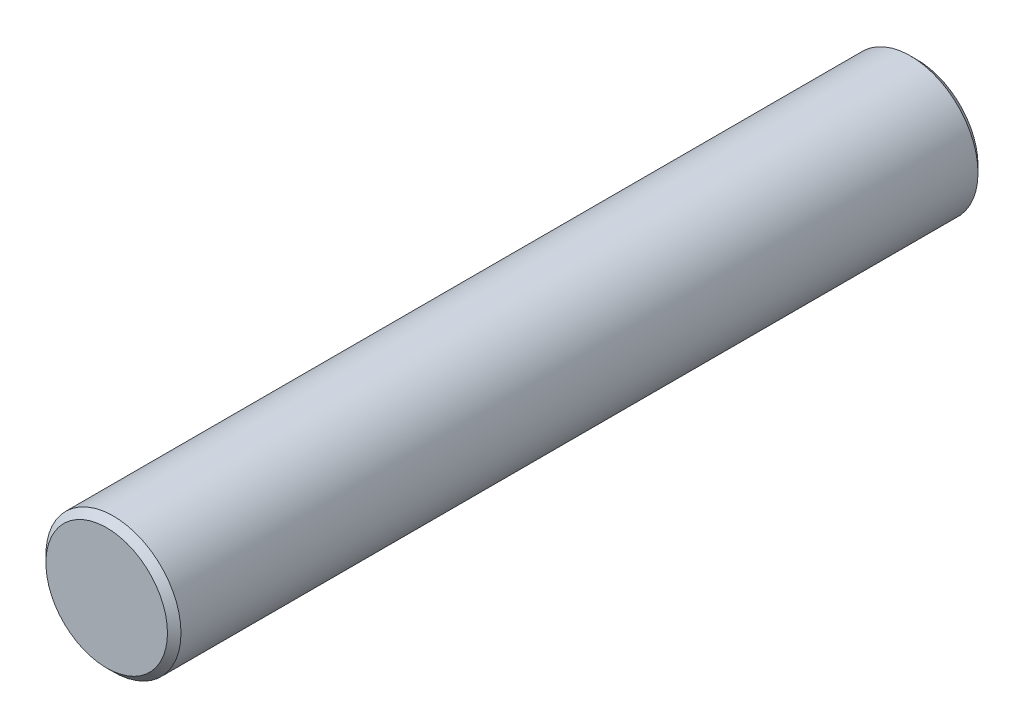
ISO-10303-21;
HEADER;
FILE_DESCRIPTION(('STEP AP214'),'2;1');
FILE_NAME('part.step','',(''),(''),'','','');
FILE_SCHEMA(('AUTOMOTIVE_DESIGN { 1 0 10303 214 1 1 1 1 }'));
ENDSEC;
DATA;
#1=APPLICATION_CONTEXT('core data for automotive mechanical design processes');
#2=APPLICATION_PROTOCOL_DEFINITION('international standard','automotive_design',2000,#1);
#3=PRODUCT_CONTEXT('',#1,'mechanical');
#4=PRODUCT('Part','Part','',(#3));
#5=PRODUCT_RELATED_PRODUCT_CATEGORY('part','',(#4));
#6=PRODUCT_DEFINITION_FORMATION('','',#4);
#7=PRODUCT_DEFINITION_CONTEXT('part definition',#1,'design');
#8=PRODUCT_DEFINITION('design','',#6,#7);
#9=PRODUCT_DEFINITION_SHAPE('','',#8);
#10=(LENGTH_UNIT() NAMED_UNIT(*) SI_UNIT(.MILLI.,.METRE.));
#11=(NAMED_UNIT(*) PLANE_ANGLE_UNIT() SI_UNIT($,.RADIAN.));
#12=(NAMED_UNIT(*) SI_UNIT($,.STERADIAN.) SOLID_ANGLE_UNIT());
#13=UNCERTAINTY_MEASURE_WITH_UNIT(LENGTH_MEASURE(1.E-05),#10,'distance_accuracy_value','');
#14=(GEOMETRIC_REPRESENTATION_CONTEXT(3) GLOBAL_UNCERTAINTY_ASSIGNED_CONTEXT((#13)) GLOBAL_UNIT_ASSIGNED_CONTEXT((#10,
#11,#12)) REPRESENTATION_CONTEXT('',''));
#15=CARTESIAN_POINT('',(0.,0.,0.));
#16=DIRECTION('',(0.,0.,1.));
#17=DIRECTION('',(1.,0.,0.));
#18=AXIS2_PLACEMENT_3D('',#15,#16,#17);
#19=CARTESIAN_POINT('',(0.,0.,12.));
#20=DIRECTION('',(0.,0.,-1.));
#21=DIRECTION('',(-1.,0.,0.));
#22=AXIS2_PLACEMENT_3D('',#19,#20,#21);
#23=CYLINDRICAL_SURFACE('',#22,1.);
#24=CARTESIAN_POINT('',(0.,0.,0.100000000000003));
#25=DIRECTION('',(0.,0.,1.));
#26=DIRECTION('',(1.,0.,0.));
#27=AXIS2_PLACEMENT_3D('',#24,#25,#26);
#28=CIRCLE('',#27,1.);
#29=CARTESIAN_POINT('',(1.,0.,0.100000000000003));
#30=VERTEX_POINT('',#29);
#31=EDGE_CURVE('E58',#30,#30,#28,.T.);
#32=ORIENTED_EDGE('',*,*,#31,.T.);
#33=EDGE_LOOP('',(#32));
#34=FACE_BOUND('',#33,.T.);
#35=CARTESIAN_POINT('',(0.,0.,11.9));
#36=DIRECTION('',(0.,0.,1.));
#37=DIRECTION('',(1.,0.,0.));
#38=AXIS2_PLACEMENT_3D('',#35,#36,#37);
#39=CIRCLE('',#38,1.);
#40=CARTESIAN_POINT('',(1.,0.,11.9));
#41=VERTEX_POINT('',#40);
#42=EDGE_CURVE('E63',#41,#41,#39,.F.);
#43=ORIENTED_EDGE('',*,*,#42,.T.);
#44=EDGE_LOOP('',(#43));
#45=FACE_BOUND('',#44,.T.);
#46=ADVANCED_FACE('F44',(#34,#45),#23,.T.);
#47=CARTESIAN_POINT('',(0.,0.,12.));
#48=DIRECTION('',(0.,0.,1.));
#49=DIRECTION('',(1.,0.,0.));
#50=AXIS2_PLACEMENT_3D('',#47,#48,#49);
#51=PLANE('',#50);
#52=CARTESIAN_POINT('',(0.,0.,12.));
#53=DIRECTION('',(0.,0.,1.));
#54=DIRECTION('',(1.,0.,0.));
#55=AXIS2_PLACEMENT_3D('',#52,#53,#54);
#56=CIRCLE('',#55,0.9);
#57=CARTESIAN_POINT('',(0.9,0.,12.));
#58=VERTEX_POINT('',#57);
#59=EDGE_CURVE('E10',#58,#58,#56,.T.);
#60=ORIENTED_EDGE('',*,*,#59,.T.);
#61=EDGE_LOOP('',(#60));
#62=FACE_BOUND('',#61,.T.);
#63=ADVANCED_FACE('F80',(#62),#51,.T.);
#64=CARTESIAN_POINT('',(0.,0.,0.));
#65=DIRECTION('',(0.,0.,1.));
#66=DIRECTION('',(1.,0.,0.));
#67=AXIS2_PLACEMENT_3D('',#64,#65,#66);
#68=PLANE('',#67);
#69=CARTESIAN_POINT('',(0.,0.,0.));
#70=DIRECTION('',(0.,0.,1.));
#71=DIRECTION('',(1.,0.,0.));
#72=AXIS2_PLACEMENT_3D('',#69,#70,#71);
#73=CIRCLE('',#72,0.899999999999998);
#74=CARTESIAN_POINT('',(0.899999999999998,0.,0.));
#75=VERTEX_POINT('',#74);
#76=EDGE_CURVE('E53',#75,#75,#73,.F.);
#77=ORIENTED_EDGE('',*,*,#76,.T.);
#78=EDGE_LOOP('',(#77));
#79=FACE_BOUND('',#78,.T.);
#80=ADVANCED_FACE('F77',(#79),#68,.F.);
#81=CARTESIAN_POINT('',(0.,0.,0.100000000000003));
#82=DIRECTION('',(0.,0.,1.));
#83=DIRECTION('',(1.,0.,0.));
#84=AXIS2_PLACEMENT_3D('',#81,#82,#83);
#85=CONICAL_SURFACE('',#84,1.,0.785398163397444);
#86=ORIENTED_EDGE('',*,*,#76,.F.);
#87=EDGE_LOOP('',(#86));
#88=FACE_BOUND('',#87,.T.);
#89=ORIENTED_EDGE('',*,*,#31,.F.);
#90=EDGE_LOOP('',(#89));
#91=FACE_BOUND('',#90,.T.);
#92=ADVANCED_FACE('F73',(#88,#91),#85,.T.);
#93=CARTESIAN_POINT('',(0.,0.,12.));
#94=DIRECTION('',(0.,0.,-1.));
#95=DIRECTION('',(-1.,0.,0.));
#96=AXIS2_PLACEMENT_3D('',#93,#94,#95);
#97=CONICAL_SURFACE('',#96,0.9,0.785398163397453);
#98=ORIENTED_EDGE('',*,*,#42,.F.);
#99=EDGE_LOOP('',(#98));
#100=FACE_BOUND('',#99,.T.);
#101=ORIENTED_EDGE('',*,*,#59,.F.);
#102=EDGE_LOOP('',(#101));
#103=FACE_BOUND('',#102,.T.);
#104=ADVANCED_FACE('F47',(#100,#103),#97,.T.);
#105=CLOSED_SHELL('',(#46,#63,#80,#92,#104));
#106=MANIFOLD_SOLID_BREP('B2',#105);
#107=ADVANCED_BREP_SHAPE_REPRESENTATION('',(#18,#106),#14);
#108=SHAPE_DEFINITION_REPRESENTATION(#9,#107);
ENDSEC;
END-ISO-10303-21;
